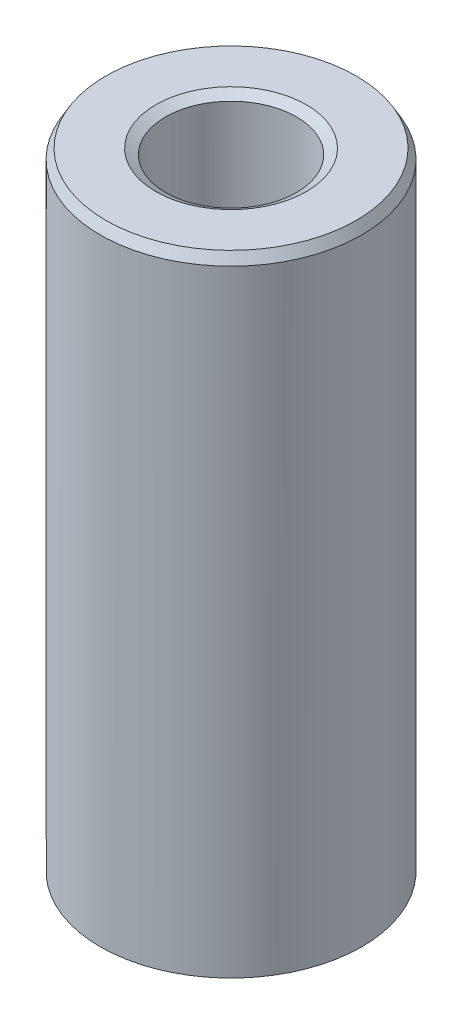
ISO-10303-21;
HEADER;
FILE_DESCRIPTION(('STEP AP214'),'2;1');
FILE_NAME('part.step','',(''),(''),'','','');
FILE_SCHEMA(('AUTOMOTIVE_DESIGN { 1 0 10303 214 1 1 1 1 }'));
ENDSEC;
DATA;
#1=APPLICATION_CONTEXT('core data for automotive mechanical design processes');
#2=APPLICATION_PROTOCOL_DEFINITION('international standard','automotive_design',2000,#1);
#3=PRODUCT_CONTEXT('',#1,'mechanical');
#4=PRODUCT('Part','Part','',(#3));
#5=PRODUCT_RELATED_PRODUCT_CATEGORY('part','',(#4));
#6=PRODUCT_DEFINITION_FORMATION('','',#4);
#7=PRODUCT_DEFINITION_CONTEXT('part definition',#1,'design');
#8=PRODUCT_DEFINITION('design','',#6,#7);
#9=PRODUCT_DEFINITION_SHAPE('','',#8);
#10=(LENGTH_UNIT() NAMED_UNIT(*) SI_UNIT(.MILLI.,.METRE.));
#11=(NAMED_UNIT(*) PLANE_ANGLE_UNIT() SI_UNIT($,.RADIAN.));
#12=(NAMED_UNIT(*) SI_UNIT($,.STERADIAN.) SOLID_ANGLE_UNIT());
#13=UNCERTAINTY_MEASURE_WITH_UNIT(LENGTH_MEASURE(1.E-05),#10,'distance_accuracy_value','');
#14=(GEOMETRIC_REPRESENTATION_CONTEXT(3) GLOBAL_UNCERTAINTY_ASSIGNED_CONTEXT((#13)) GLOBAL_UNIT_ASSIGNED_CONTEXT((#10,
#11,#12)) REPRESENTATION_CONTEXT('',''));
#15=CARTESIAN_POINT('',(0.,0.,0.));
#16=DIRECTION('',(0.,0.,1.));
#17=DIRECTION('',(1.,0.,0.));
#18=AXIS2_PLACEMENT_3D('',#15,#16,#17);
#19=CARTESIAN_POINT('',(0.,229.461709727804,0.));
#20=DIRECTION('',(0.,-1.,0.));
#21=DIRECTION('',(0.,0.,-1.));
#22=AXIS2_PLACEMENT_3D('',#19,#20,#21);
#23=CYLINDRICAL_SURFACE('',#22,47.5);
#24=CARTESIAN_POINT('',(0.,2.04776636803819,0.));
#25=DIRECTION('',(0.,1.,0.));
#26=DIRECTION('',(0.,0.,1.));
#27=AXIS2_PLACEMENT_3D('',#24,#25,#26);
#28=CIRCLE('',#27,47.5);
#29=CARTESIAN_POINT('',(0.,2.04776636803816,-47.5));
#30=VERTEX_POINT('',#29);
#31=EDGE_CURVE('E10',#30,#30,#28,.T.);
#32=CARTESIAN_POINT('',(0.,225.914874336331,0.));
#33=DIRECTION('',(0.,1.,0.));
#34=DIRECTION('',(0.,0.,1.));
#35=AXIS2_PLACEMENT_3D('',#32,#33,#34);
#36=CIRCLE('',#35,47.5);
#37=CARTESIAN_POINT('',(0.,225.914874336331,-47.5));
#38=VERTEX_POINT('',#37);
#39=EDGE_CURVE('E50',#38,#38,#36,.F.);
#40=CARTESIAN_POINT('',(0.,2.04776636803816,-47.5));
#41=CARTESIAN_POINT('',(0.,4.37971540937455,-47.5));
#42=CARTESIAN_POINT('',(0.,6.71166445071094,-47.5));
#43=CARTESIAN_POINT('',(0.,11.3755625333837,-47.5));
#44=CARTESIAN_POINT('',(0.,13.7075115747201,-47.5));
#45=CARTESIAN_POINT('',(0.,18.3714096573929,-47.5));
#46=CARTESIAN_POINT('',(0.,20.7033586987292,-47.5));
#47=CARTESIAN_POINT('',(0.,25.367256781402,-47.5));
#48=CARTESIAN_POINT('',(0.,27.6992058227384,-47.5));
#49=CARTESIAN_POINT('',(0.,32.3631039054112,-47.5));
#50=CARTESIAN_POINT('',(0.,34.6950529467476,-47.5));
#51=CARTESIAN_POINT('',(0.,39.3589510294203,-47.5));
#52=CARTESIAN_POINT('',(0.,41.6909000707567,-47.5));
#53=CARTESIAN_POINT('',(0.,46.3547981534295,-47.5));
#54=CARTESIAN_POINT('',(0.,48.6867471947659,-47.5));
#55=CARTESIAN_POINT('',(0.,53.3506452774387,-47.5));
#56=CARTESIAN_POINT('',(0.,55.682594318775,-47.5));
#57=CARTESIAN_POINT('',(0.,60.3464924014478,-47.5));
#58=CARTESIAN_POINT('',(0.,62.6784414427842,-47.5));
#59=CARTESIAN_POINT('',(0.,67.342339525457,-47.5));
#60=CARTESIAN_POINT('',(0.,69.6742885667934,-47.5));
#61=CARTESIAN_POINT('',(0.,74.3381866494661,-47.5));
#62=CARTESIAN_POINT('',(0.,76.6701356908025,-47.5));
#63=CARTESIAN_POINT('',(0.,81.3340337734753,-47.5));
#64=CARTESIAN_POINT('',(0.,83.6659828148117,-47.5));
#65=CARTESIAN_POINT('',(0.,88.3298808974844,-47.5));
#66=CARTESIAN_POINT('',(0.,90.6618299388208,-47.5));
#67=CARTESIAN_POINT('',(0.,95.3257280214936,-47.5));
#68=CARTESIAN_POINT('',(0.,97.65767706283,-47.5));
#69=CARTESIAN_POINT('',(0.,102.321575145503,-47.5));
#70=CARTESIAN_POINT('',(0.,104.653524186839,-47.5));
#71=CARTESIAN_POINT('',(0.,109.317422269512,-47.5));
#72=CARTESIAN_POINT('',(0.,111.649371310848,-47.5));
#73=CARTESIAN_POINT('',(0.,116.313269393521,-47.5));
#74=CARTESIAN_POINT('',(0.,118.645218434857,-47.5));
#75=CARTESIAN_POINT('',(0.,123.30911651753,-47.5));
#76=CARTESIAN_POINT('',(0.,125.641065558867,-47.5));
#77=CARTESIAN_POINT('',(0.,130.304963641539,-47.5));
#78=CARTESIAN_POINT('',(0.,132.636912682876,-47.5));
#79=CARTESIAN_POINT('',(0.,137.300810765549,-47.5));
#80=CARTESIAN_POINT('',(0.,139.632759806885,-47.5));
#81=CARTESIAN_POINT('',(0.,144.296657889558,-47.5));
#82=CARTESIAN_POINT('',(0.,146.628606930894,-47.5));
#83=CARTESIAN_POINT('',(0.,151.292505013567,-47.5));
#84=CARTESIAN_POINT('',(0.,153.624454054903,-47.5));
#85=CARTESIAN_POINT('',(0.,158.288352137576,-47.5));
#86=CARTESIAN_POINT('',(0.,160.620301178912,-47.5));
#87=CARTESIAN_POINT('',(0.,165.284199261585,-47.5));
#88=CARTESIAN_POINT('',(0.,167.616148302922,-47.5));
#89=CARTESIAN_POINT('',(0.,172.280046385594,-47.5));
#90=CARTESIAN_POINT('',(0.,174.611995426931,-47.5));
#91=CARTESIAN_POINT('',(0.,179.275893509603,-47.5));
#92=CARTESIAN_POINT('',(0.,181.60784255094,-47.5));
#93=CARTESIAN_POINT('',(0.,186.271740633613,-47.5));
#94=CARTESIAN_POINT('',(0.,188.603689674949,-47.5));
#95=CARTESIAN_POINT('',(0.,193.267587757622,-47.5));
#96=CARTESIAN_POINT('',(0.,195.599536798958,-47.5));
#97=CARTESIAN_POINT('',(0.,200.263434881631,-47.5));
#98=CARTESIAN_POINT('',(0.,202.595383922967,-47.5));
#99=CARTESIAN_POINT('',(0.,207.25928200564,-47.5));
#100=CARTESIAN_POINT('',(0.,209.591231046977,-47.5));
#101=CARTESIAN_POINT('',(0.,214.255129129649,-47.5));
#102=CARTESIAN_POINT('',(0.,216.587078170986,-47.5));
#103=CARTESIAN_POINT('',(0.,221.250976253658,-47.5));
#104=CARTESIAN_POINT('',(0.,223.582925294995,-47.5));
#105=CARTESIAN_POINT('',(0.,225.914874336331,-47.5));
#106=B_SPLINE_CURVE_WITH_KNOTS('',3,(#40,#41,#42,#43,#44,#45,#46,#47,#48,#49,#50,#51,#52,#53,
#54,#55,#56,#57,#58,#59,#60,#61,#62,#63,#64,#65,#66,#67,#68,#69,#70,#71,#72,#73,#74,#75,#76,#77,
#78,#79,#80,#81,#82,#83,#84,#85,#86,#87,#88,#89,#90,#91,#92,#93,#94,#95,#96,#97,#98,#99,#100,
#101,#102,#103,#104,#105),.UNSPECIFIED.,.F.,.F.,(4,2,2,2,2,2,2,2,2,2,2,2,2,2,2,2,2,2,2,2,2,2,2,
2,2,2,2,2,2,2,2,2,4),(0.,6.99584712400916,13.9916942480183,20.9875413720275,27.9833884960366,
34.9792356200458,41.975082744055,48.9709298680641,55.9667769920732,62.9626241160824,
69.9584712400916,76.9543183641007,83.9501654881099,90.946012612119,97.9418597361282,
104.937706860137,111.933553984147,118.929401108156,125.925248232165,132.921095356174,
139.916942480183,146.912789604192,153.908636728201,160.904483852211,167.90033097622,
174.896178100229,181.892025224238,188.887872348247,195.883719472256,202.879566596266,
209.875413720275,216.871260844284,223.867107968293),.UNSPECIFIED.);
#107=EDGE_CURVE('BSEAM39',#30,#38,#106,.T.);
#108=ORIENTED_EDGE('',*,*,#31,.T.);
#109=ORIENTED_EDGE('',*,*,#39,.T.);
#110=ORIENTED_EDGE('',*,*,#107,.T.);
#111=ORIENTED_EDGE('',*,*,#107,.F.);
#112=EDGE_LOOP('',(#108,#110,#109,#111));
#113=FACE_BOUND('',#112,.T.);
#114=ADVANCED_FACE('F39',(#113),#23,.T.);
#115=CARTESIAN_POINT('',(0.,229.461709727804,0.));
#116=DIRECTION('',(0.,1.,0.));
#117=DIRECTION('',(0.,0.,1.));
#118=AXIS2_PLACEMENT_3D('',#115,#116,#117);
#119=PLANE('',#118);
#120=CARTESIAN_POINT('',(0.,229.461709727804,0.));
#121=DIRECTION('',(0.,1.,0.));
#122=DIRECTION('',(0.,0.,1.));
#123=AXIS2_PLACEMENT_3D('',#120,#121,#122);
#124=CIRCLE('',#123,27.3430563154951);
#125=CARTESIAN_POINT('',(0.,229.461709727804,27.3430563154951));
#126=VERTEX_POINT('',#125);
#127=EDGE_CURVE('E58',#126,#126,#124,.F.);
#128=ORIENTED_EDGE('',*,*,#127,.T.);
#129=EDGE_LOOP('',(#128));
#130=FACE_BOUND('',#129,.T.);
#131=CARTESIAN_POINT('',(0.,229.461709727804,0.));
#132=DIRECTION('',(0.,1.,0.));
#133=DIRECTION('',(0.,0.,1.));
#134=AXIS2_PLACEMENT_3D('',#131,#132,#133);
#135=CIRCLE('',#134,45.452233631962);
#136=CARTESIAN_POINT('',(0.,229.461709727804,45.452233631962));
#137=VERTEX_POINT('',#136);
#138=EDGE_CURVE('E61',#137,#137,#135,.T.);
#139=ORIENTED_EDGE('',*,*,#138,.T.);
#140=EDGE_LOOP('',(#139));
#141=FACE_BOUND('',#140,.T.);
#142=ADVANCED_FACE('F88',(#130,#141),#119,.T.);
#143=CARTESIAN_POINT('',(0.,0.,0.));
#144=DIRECTION('',(0.,1.,0.));
#145=DIRECTION('',(0.,0.,1.));
#146=AXIS2_PLACEMENT_3D('',#143,#144,#145);
#147=PLANE('',#146);
#148=CARTESIAN_POINT('',(0.,0.,0.));
#149=DIRECTION('',(0.,1.,0.));
#150=DIRECTION('',(0.,0.,1.));
#151=AXIS2_PLACEMENT_3D('',#148,#149,#150);
#152=CIRCLE('',#151,25.8439872920602);
#153=CARTESIAN_POINT('',(0.,0.,25.8439872920602));
#154=VERTEX_POINT('',#153);
#155=EDGE_CURVE('E51',#154,#154,#152,.T.);
#156=ORIENTED_EDGE('',*,*,#155,.T.);
#157=EDGE_LOOP('',(#156));
#158=FACE_BOUND('',#157,.T.);
#159=CARTESIAN_POINT('',(0.,0.,0.));
#160=DIRECTION('',(0.,1.,0.));
#161=DIRECTION('',(0.,0.,1.));
#162=AXIS2_PLACEMENT_3D('',#159,#160,#161);
#163=CIRCLE('',#162,43.9531646085271);
#164=CARTESIAN_POINT('',(0.,0.,43.9531646085271));
#165=VERTEX_POINT('',#164);
#166=EDGE_CURVE('E54',#165,#165,#163,.F.);
#167=ORIENTED_EDGE('',*,*,#166,.T.);
#168=EDGE_LOOP('',(#167));
#169=FACE_BOUND('',#168,.T.);
#170=ADVANCED_FACE('F83',(#158,#169),#147,.F.);
#171=CARTESIAN_POINT('',(0.,229.461709727804,0.));
#172=DIRECTION('',(0.,-1.,0.));
#173=DIRECTION('',(0.,0.,-1.));
#174=AXIS2_PLACEMENT_3D('',#171,#172,#173);
#175=CYLINDRICAL_SURFACE('',#174,23.7962209240222);
#176=CARTESIAN_POINT('',(0.,227.413943359766,0.));
#177=DIRECTION('',(0.,1.,0.));
#178=DIRECTION('',(0.,0.,1.));
#179=AXIS2_PLACEMENT_3D('',#176,#177,#178);
#180=CIRCLE('',#179,23.7962209240222);
#181=CARTESIAN_POINT('',(0.,227.413943359766,-23.7962209240222));
#182=VERTEX_POINT('',#181);
#183=EDGE_CURVE('E67',#182,#182,#180,.T.);
#184=CARTESIAN_POINT('',(0.,3.54683539147277,0.));
#185=DIRECTION('',(0.,1.,0.));
#186=DIRECTION('',(0.,0.,1.));
#187=AXIS2_PLACEMENT_3D('',#184,#185,#186);
#188=CIRCLE('',#187,23.7962209240222);
#189=CARTESIAN_POINT('',(0.,3.54683539147277,-23.7962209240222));
#190=VERTEX_POINT('',#189);
#191=EDGE_CURVE('E69',#190,#190,#188,.F.);
#192=CARTESIAN_POINT('',(0.,227.413943359766,-23.7962209240222));
#193=CARTESIAN_POINT('',(0.,225.081994318429,-23.7962209240222));
#194=CARTESIAN_POINT('',(0.,222.750045277093,-23.7962209240222));
#195=CARTESIAN_POINT('',(0.,218.08614719442,-23.7962209240222));
#196=CARTESIAN_POINT('',(0.,215.754198153084,-23.7962209240222));
#197=CARTESIAN_POINT('',(0.,211.090300070411,-23.7962209240222));
#198=CARTESIAN_POINT('',(0.,208.758351029075,-23.7962209240222));
#199=CARTESIAN_POINT('',(0.,204.094452946402,-23.7962209240222));
#200=CARTESIAN_POINT('',(0.,201.762503905065,-23.7962209240222));
#201=CARTESIAN_POINT('',(0.,197.098605822393,-23.7962209240222));
#202=CARTESIAN_POINT('',(0.,194.766656781056,-23.7962209240222));
#203=CARTESIAN_POINT('',(0.,190.102758698384,-23.7962209240222));
#204=CARTESIAN_POINT('',(0.,187.770809657047,-23.7962209240222));
#205=CARTESIAN_POINT('',(0.,183.106911574374,-23.7962209240222));
#206=CARTESIAN_POINT('',(0.,180.774962533038,-23.7962209240222));
#207=CARTESIAN_POINT('',(0.,176.111064450365,-23.7962209240222));
#208=CARTESIAN_POINT('',(0.,173.779115409029,-23.7962209240222));
#209=CARTESIAN_POINT('',(0.,169.115217326356,-23.7962209240222));
#210=CARTESIAN_POINT('',(0.,166.78326828502,-23.7962209240222));
#211=CARTESIAN_POINT('',(0.,162.119370202347,-23.7962209240222));
#212=CARTESIAN_POINT('',(0.,159.787421161011,-23.7962209240222));
#213=CARTESIAN_POINT('',(0.,155.123523078338,-23.7962209240222));
#214=CARTESIAN_POINT('',(0.,152.791574037001,-23.7962209240222));
#215=CARTESIAN_POINT('',(0.,148.127675954329,-23.7962209240222));
#216=CARTESIAN_POINT('',(0.,145.795726912992,-23.7962209240222));
#217=CARTESIAN_POINT('',(0.,141.131828830319,-23.7962209240222));
#218=CARTESIAN_POINT('',(0.,138.799879788983,-23.7962209240222));
#219=CARTESIAN_POINT('',(0.,134.13598170631,-23.7962209240222));
#220=CARTESIAN_POINT('',(0.,131.804032664974,-23.7962209240222));
#221=CARTESIAN_POINT('',(0.,127.140134582301,-23.7962209240222));
#222=CARTESIAN_POINT('',(0.,124.808185540965,-23.7962209240222));
#223=CARTESIAN_POINT('',(0.,120.144287458292,-23.7962209240222));
#224=CARTESIAN_POINT('',(0.,117.812338416956,-23.7962209240222));
#225=CARTESIAN_POINT('',(0.,113.148440334283,-23.7962209240222));
#226=CARTESIAN_POINT('',(0.,110.816491292946,-23.7962209240222));
#227=CARTESIAN_POINT('',(0.,106.152593210274,-23.7962209240222));
#228=CARTESIAN_POINT('',(0.,103.820644168937,-23.7962209240222));
#229=CARTESIAN_POINT('',(0.,99.1567460862645,-23.7962209240222));
#230=CARTESIAN_POINT('',(0.,96.8247970449281,-23.7962209240222));
#231=CARTESIAN_POINT('',(0.,92.1608989622554,-23.7962209240222));
#232=CARTESIAN_POINT('',(0.,89.828949920919,-23.7962209240222));
#233=CARTESIAN_POINT('',(0.,85.1650518382462,-23.7962209240222));
#234=CARTESIAN_POINT('',(0.,82.8331027969099,-23.7962209240222));
#235=CARTESIAN_POINT('',(0.,78.1692047142371,-23.7962209240222));
#236=CARTESIAN_POINT('',(0.,75.8372556729007,-23.7962209240222));
#237=CARTESIAN_POINT('',(0.,71.1733575902279,-23.7962209240222));
#238=CARTESIAN_POINT('',(0.,68.8414085488915,-23.7962209240222));
#239=CARTESIAN_POINT('',(0.,64.1775104662188,-23.7962209240222));
#240=CARTESIAN_POINT('',(0.,61.8455614248824,-23.7962209240222));
#241=CARTESIAN_POINT('',(0.,57.1816633422096,-23.7962209240222));
#242=CARTESIAN_POINT('',(0.,54.8497143008732,-23.7962209240222));
#243=CARTESIAN_POINT('',(0.,50.1858162182005,-23.7962209240222));
#244=CARTESIAN_POINT('',(0.,47.8538671768641,-23.7962209240222));
#245=CARTESIAN_POINT('',(0.,43.1899690941913,-23.7962209240222));
#246=CARTESIAN_POINT('',(0.,40.8580200528549,-23.7962209240222));
#247=CARTESIAN_POINT('',(0.,36.1941219701821,-23.7962209240222));
#248=CARTESIAN_POINT('',(0.,33.8621729288458,-23.7962209240222));
#249=CARTESIAN_POINT('',(0.,29.198274846173,-23.7962209240222));
#250=CARTESIAN_POINT('',(0.,26.8663258048366,-23.7962209240222));
#251=CARTESIAN_POINT('',(0.,22.2024277221638,-23.7962209240222));
#252=CARTESIAN_POINT('',(0.,19.8704786808275,-23.7962209240222));
#253=CARTESIAN_POINT('',(0.,15.2065805981547,-23.7962209240222));
#254=CARTESIAN_POINT('',(0.,12.8746315568183,-23.7962209240222));
#255=CARTESIAN_POINT('',(0.,8.21073347414554,-23.7962209240222));
#256=CARTESIAN_POINT('',(0.,5.87878443280916,-23.7962209240222));
#257=CARTESIAN_POINT('',(0.,3.54683539147277,-23.7962209240222));
#258=B_SPLINE_CURVE_WITH_KNOTS('',3,(#192,#193,#194,#195,#196,#197,#198,#199,#200,#201,#202,
#203,#204,#205,#206,#207,#208,#209,#210,#211,#212,#213,#214,#215,#216,#217,#218,#219,#220,#221,
#222,#223,#224,#225,#226,#227,#228,#229,#230,#231,#232,#233,#234,#235,#236,#237,#238,#239,#240,
#241,#242,#243,#244,#245,#246,#247,#248,#249,#250,#251,#252,#253,#254,#255,#256,#257),
.UNSPECIFIED.,.F.,.F.,(4,2,2,2,2,2,2,2,2,2,2,2,2,2,2,2,2,2,2,2,2,2,2,2,2,2,2,2,2,2,2,2,4),(0.,
6.99584712400914,13.9916942480183,20.9875413720274,27.9833884960366,34.9792356200457,
41.9750827440549,48.9709298680641,55.9667769920732,62.9626241160824,69.9584712400915,
76.9543183641007,83.9501654881098,90.946012612119,97.9418597361281,104.937706860137,
111.933553984146,118.929401108156,125.925248232165,132.921095356174,139.916942480183,
146.912789604192,153.908636728201,160.90448385221,167.90033097622,174.896178100229,
181.892025224238,188.887872348247,195.883719472256,202.879566596265,209.875413720275,
216.871260844284,223.867107968293),.UNSPECIFIED.);
#259=EDGE_CURVE('BSEAM71',#182,#190,#258,.T.);
#260=ORIENTED_EDGE('',*,*,#183,.T.);
#261=ORIENTED_EDGE('',*,*,#191,.T.);
#262=ORIENTED_EDGE('',*,*,#259,.T.);
#263=ORIENTED_EDGE('',*,*,#259,.F.);
#264=EDGE_LOOP('',(#260,#262,#261,#263));
#265=FACE_BOUND('',#264,.T.);
#266=ADVANCED_FACE('F71',(#265),#175,.F.);
#267=CARTESIAN_POINT('',(0.,227.413943359766,0.));
#268=DIRECTION('',(0.,1.,0.));
#269=DIRECTION('',(0.,0.,1.));
#270=AXIS2_PLACEMENT_3D('',#267,#268,#269);
#271=CONICAL_SURFACE('',#270,23.7962209240222,1.0471975511966);
#272=ORIENTED_EDGE('',*,*,#127,.F.);
#273=EDGE_LOOP('',(#272));
#274=FACE_BOUND('',#273,.T.);
#275=ORIENTED_EDGE('',*,*,#183,.F.);
#276=EDGE_LOOP('',(#275));
#277=FACE_BOUND('',#276,.T.);
#278=ADVANCED_FACE('F77',(#274,#277),#271,.F.);
#279=CARTESIAN_POINT('',(0.,0.,0.));
#280=DIRECTION('',(0.,-1.,0.));
#281=DIRECTION('',(0.,0.,-1.));
#282=AXIS2_PLACEMENT_3D('',#279,#280,#281);
#283=CONICAL_SURFACE('',#282,25.8439872920602,0.523598775598295);
#284=ORIENTED_EDGE('',*,*,#191,.F.);
#285=EDGE_LOOP('',(#284));
#286=FACE_BOUND('',#285,.T.);
#287=ORIENTED_EDGE('',*,*,#155,.F.);
#288=EDGE_LOOP('',(#287));
#289=FACE_BOUND('',#288,.T.);
#290=ADVANCED_FACE('F73',(#286,#289),#283,.F.);
#291=CARTESIAN_POINT('',(0.,2.04776636803819,0.));
#292=DIRECTION('',(0.,1.,0.));
#293=DIRECTION('',(0.,0.,1.));
#294=AXIS2_PLACEMENT_3D('',#291,#292,#293);
#295=CONICAL_SURFACE('',#294,47.5,1.0471975511966);
#296=ORIENTED_EDGE('',*,*,#166,.F.);
#297=EDGE_LOOP('',(#296));
#298=FACE_BOUND('',#297,.T.);
#299=ORIENTED_EDGE('',*,*,#31,.F.);
#300=EDGE_LOOP('',(#299));
#301=FACE_BOUND('',#300,.T.);
#302=ADVANCED_FACE('F76',(#298,#301),#295,.T.);
#303=CARTESIAN_POINT('',(0.,229.461709727804,0.));
#304=DIRECTION('',(0.,-1.,0.));
#305=DIRECTION('',(0.,0.,-1.));
#306=AXIS2_PLACEMENT_3D('',#303,#304,#305);
#307=CONICAL_SURFACE('',#306,45.452233631962,0.523598775598301);
#308=ORIENTED_EDGE('',*,*,#39,.F.);
#309=EDGE_LOOP('',(#308));
#310=FACE_BOUND('',#309,.T.);
#311=ORIENTED_EDGE('',*,*,#138,.F.);
#312=EDGE_LOOP('',(#311));
#313=FACE_BOUND('',#312,.T.);
#314=ADVANCED_FACE('F45',(#310,#313),#307,.T.);
#315=CLOSED_SHELL('',(#114,#142,#170,#266,#278,#290,#302,#314));
#316=MANIFOLD_SOLID_BREP('B2',#315);
#317=ADVANCED_BREP_SHAPE_REPRESENTATION('',(#18,#316),#14);
#318=SHAPE_DEFINITION_REPRESENTATION(#9,#317);
ENDSEC;
END-ISO-10303-21;
